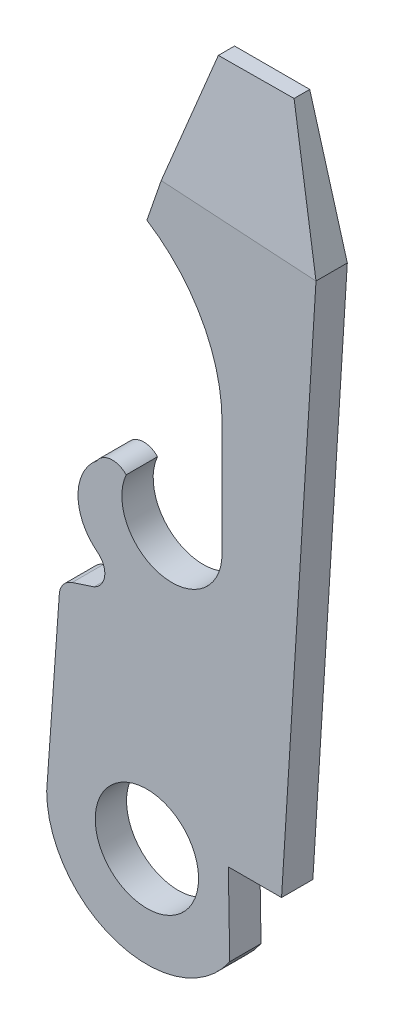
ISO-10303-21;
HEADER;
FILE_DESCRIPTION(('STEP AP214'),'2;1');
FILE_NAME('part.step','',(''),(''),'','','');
FILE_SCHEMA(('AUTOMOTIVE_DESIGN { 1 0 10303 214 1 1 1 1 }'));
ENDSEC;
DATA;
#1=APPLICATION_CONTEXT('core data for automotive mechanical design processes');
#2=APPLICATION_PROTOCOL_DEFINITION('international standard','automotive_design',2000,#1);
#3=PRODUCT_CONTEXT('',#1,'mechanical');
#4=PRODUCT('Part','Part','',(#3));
#5=PRODUCT_RELATED_PRODUCT_CATEGORY('part','',(#4));
#6=PRODUCT_DEFINITION_FORMATION('','',#4);
#7=PRODUCT_DEFINITION_CONTEXT('part definition',#1,'design');
#8=PRODUCT_DEFINITION('design','',#6,#7);
#9=PRODUCT_DEFINITION_SHAPE('','',#8);
#10=(LENGTH_UNIT() NAMED_UNIT(*) SI_UNIT(.MILLI.,.METRE.));
#11=(NAMED_UNIT(*) PLANE_ANGLE_UNIT() SI_UNIT($,.RADIAN.));
#12=(NAMED_UNIT(*) SI_UNIT($,.STERADIAN.) SOLID_ANGLE_UNIT());
#13=UNCERTAINTY_MEASURE_WITH_UNIT(LENGTH_MEASURE(1.E-05),#10,'distance_accuracy_value','');
#14=(GEOMETRIC_REPRESENTATION_CONTEXT(3) GLOBAL_UNCERTAINTY_ASSIGNED_CONTEXT((#13)) GLOBAL_UNIT_ASSIGNED_CONTEXT((#10,
#11,#12)) REPRESENTATION_CONTEXT('',''));
#15=CARTESIAN_POINT('',(0.,0.,0.));
#16=DIRECTION('',(0.,0.,1.));
#17=DIRECTION('',(1.,0.,0.));
#18=AXIS2_PLACEMENT_3D('',#15,#16,#17);
#19=CARTESIAN_POINT('',(47.112724970247,45.3500704609039,1.27));
#20=DIRECTION('',(-0.961523947640823,-0.274721127897379,0.));
#21=DIRECTION('',(0.274721127897379,-0.961523947640823,0.));
#22=AXIS2_PLACEMENT_3D('',#19,#20,#21);
#23=PLANE('',#22);
#24=DIRECTION('',(0.,0.,-1.));
#25=VECTOR('',#24,1.);
#26=CARTESIAN_POINT('',(47.112724970247,45.3500704609039,1.27));
#27=LINE('',#26,#25);
#28=CARTESIAN_POINT('',(47.1127249702472,45.3500704609039,0.635));
#29=VERTEX_POINT('',#28);
#30=CARTESIAN_POINT('',(47.112724970247,45.3500704609039,0.));
#31=VERTEX_POINT('',#30);
#32=EDGE_CURVE('E51',#29,#31,#27,.T.);
#33=ORIENTED_EDGE('',*,*,#32,.F.);
#34=DIRECTION('',(0.272938825911814,-0.955285890691345,0.113724510796589));
#35=VECTOR('',#34,1.);
#36=CARTESIAN_POINT('',(47.1324352651254,45.2810844288294,0.643212622866014));
#37=LINE('',#36,#35);
#38=CARTESIAN_POINT('',(48.636724970247,40.0160704609039,1.27));
#39=VERTEX_POINT('',#38);
#40=EDGE_CURVE('E317',#29,#39,#37,.T.);
#41=ORIENTED_EDGE('',*,*,#40,.T.);
#42=DIRECTION('',(0.,0.,-1.));
#43=VECTOR('',#42,1.);
#44=CARTESIAN_POINT('',(48.636724970247,40.0160704609039,1.27));
#45=LINE('',#44,#43);
#46=CARTESIAN_POINT('',(48.636724970247,40.0160704609039,0.));
#47=VERTEX_POINT('',#46);
#48=EDGE_CURVE('E200',#39,#47,#45,.T.);
#49=ORIENTED_EDGE('',*,*,#48,.T.);
#50=DIRECTION('',(-0.274721127897379,0.961523947640823,0.));
#51=VECTOR('',#50,1.);
#52=CARTESIAN_POINT('',(47.112724970247,45.3500704609039,0.));
#53=LINE('',#52,#51);
#54=EDGE_CURVE('E201',#47,#31,#53,.T.);
#55=ORIENTED_EDGE('',*,*,#54,.T.);
#56=EDGE_LOOP('',(#33,#41,#49,#55));
#57=FACE_BOUND('',#56,.T.);
#58=ADVANCED_FACE('F43',(#57),#23,.F.);
#59=CARTESIAN_POINT('',(44.064724970247,45.3500704609039,1.27));
#60=DIRECTION('',(0.,-1.,0.));
#61=DIRECTION('',(0.,0.,-1.));
#62=AXIS2_PLACEMENT_3D('',#59,#60,#61);
#63=PLANE('',#62);
#64=DIRECTION('',(0.,0.,-1.));
#65=VECTOR('',#64,1.);
#66=CARTESIAN_POINT('',(44.064724970247,45.3500704609039,1.27));
#67=LINE('',#66,#65);
#68=CARTESIAN_POINT('',(44.064724970247,45.3500704609039,0.658090909090911));
#69=VERTEX_POINT('',#68);
#70=CARTESIAN_POINT('',(44.064724970247,45.3500704609039,0.));
#71=VERTEX_POINT('',#70);
#72=EDGE_CURVE('E295',#69,#71,#67,.T.);
#73=ORIENTED_EDGE('',*,*,#72,.F.);
#74=DIRECTION('',(0.999971305183713,0.,-0.00757554019078572));
#75=VECTOR('',#74,1.);
#76=CARTESIAN_POINT('',(44.0600895613517,45.3500704609039,0.658126025824966));
#77=LINE('',#76,#75);
#78=EDGE_CURVE('E308',#69,#29,#77,.T.);
#79=ORIENTED_EDGE('',*,*,#78,.T.);
#80=ORIENTED_EDGE('',*,*,#32,.T.);
#81=DIRECTION('',(-1.,0.,0.));
#82=VECTOR('',#81,1.);
#83=CARTESIAN_POINT('',(44.064724970247,45.3500704609039,0.));
#84=LINE('',#83,#82);
#85=EDGE_CURVE('E205',#31,#71,#84,.T.);
#86=ORIENTED_EDGE('',*,*,#85,.T.);
#87=EDGE_LOOP('',(#73,#79,#80,#86));
#88=FACE_BOUND('',#87,.T.);
#89=ADVANCED_FACE('F305',(#88),#63,.F.);
#90=CARTESIAN_POINT('',(44.064724970247,45.3500704609039,1.27));
#91=DIRECTION('',(0.945338699013941,-0.326090085937353,0.));
#92=DIRECTION('',(0.326090085937353,0.945338699013941,0.));
#93=AXIS2_PLACEMENT_3D('',#90,#91,#92);
#94=PLANE('',#93);
#95=DIRECTION('',(-0.326090085937353,-0.945338699013941,0.));
#96=VECTOR('',#95,1.);
#97=CARTESIAN_POINT('',(44.064724970247,45.3500704609039,1.27));
#98=LINE('',#97,#96);
#99=CARTESIAN_POINT('',(42.3601051845153,40.4083591975121,1.27));
#100=VERTEX_POINT('',#99);
#101=CARTESIAN_POINT('',(41.778724970247,38.7229316451564,1.27));
#102=VERTEX_POINT('',#101);
#103=EDGE_CURVE('E131',#100,#102,#98,.T.);
#104=ORIENTED_EDGE('',*,*,#103,.F.);
#105=DIRECTION('',(0.32387869152296,0.93892784260075,-0.116263061917689));
#106=VECTOR('',#105,1.);
#107=CARTESIAN_POINT('',(44.0416834548802,45.2832728577278,0.666362145198362));
#108=LINE('',#107,#106);
#109=EDGE_CURVE('E57',#100,#69,#108,.T.);
#110=ORIENTED_EDGE('',*,*,#109,.T.);
#111=ORIENTED_EDGE('',*,*,#72,.T.);
#112=DIRECTION('',(-0.326090085937353,-0.945338699013941,0.));
#113=VECTOR('',#112,1.);
#114=CARTESIAN_POINT('',(44.064724970247,45.3500704609039,0.));
#115=LINE('',#114,#113);
#116=CARTESIAN_POINT('',(41.778724970247,38.7229316451564,0.));
#117=VERTEX_POINT('',#116);
#118=EDGE_CURVE('E210',#71,#117,#115,.T.);
#119=ORIENTED_EDGE('',*,*,#118,.T.);
#120=DIRECTION('',(0.,0.,-1.));
#121=VECTOR('',#120,1.);
#122=CARTESIAN_POINT('',(41.778724970247,38.7229316451564,1.27));
#123=LINE('',#122,#121);
#124=EDGE_CURVE('E291',#102,#117,#123,.T.);
#125=ORIENTED_EDGE('',*,*,#124,.F.);
#126=EDGE_LOOP('',(#104,#110,#111,#119,#125));
#127=FACE_BOUND('',#126,.T.);
#128=ADVANCED_FACE('F325',(#127),#94,.F.);
#129=CARTESIAN_POINT('',(38.222724970247,33.1580704609039,1.27));
#130=DIRECTION('',(0.,0.,-1.));
#131=DIRECTION('',(-1.,0.,0.));
#132=AXIS2_PLACEMENT_3D('',#129,#130,#131);
#133=CYLINDRICAL_SURFACE('',#132,6.604);
#134=CARTESIAN_POINT('',(38.222724970247,33.1580704609039,0.));
#135=DIRECTION('',(0.,0.,-1.));
#136=DIRECTION('',(1.,0.,0.));
#137=AXIS2_PLACEMENT_3D('',#134,#135,#136);
#138=CIRCLE('',#137,6.604);
#139=CARTESIAN_POINT('',(44.826724970247,33.1580704609039,0.));
#140=VERTEX_POINT('',#139);
#141=EDGE_CURVE('E213',#117,#140,#138,.T.);
#142=ORIENTED_EDGE('',*,*,#141,.T.);
#143=DIRECTION('',(0.,0.,-1.));
#144=VECTOR('',#143,1.);
#145=CARTESIAN_POINT('',(44.826724970247,33.1580704609039,1.27));
#146=LINE('',#145,#144);
#147=CARTESIAN_POINT('',(44.826724970247,33.1580704609039,1.27));
#148=VERTEX_POINT('',#147);
#149=EDGE_CURVE('E287',#148,#140,#146,.T.);
#150=ORIENTED_EDGE('',*,*,#149,.F.);
#151=CARTESIAN_POINT('',(38.222724970247,33.1580704609039,1.27));
#152=DIRECTION('',(0.,0.,-1.));
#153=DIRECTION('',(1.,0.,0.));
#154=AXIS2_PLACEMENT_3D('',#151,#152,#153);
#155=CIRCLE('',#154,6.604);
#156=EDGE_CURVE('E342',#102,#148,#155,.T.);
#157=ORIENTED_EDGE('',*,*,#156,.F.);
#158=ORIENTED_EDGE('',*,*,#124,.T.);
#159=EDGE_LOOP('',(#142,#150,#157,#158));
#160=FACE_BOUND('',#159,.T.);
#161=ADVANCED_FACE('F492',(#160),#133,.F.);
#162=CARTESIAN_POINT('',(44.826724970247,33.1580704609039,1.27));
#163=DIRECTION('',(1.,0.,0.));
#164=DIRECTION('',(0.,1.,0.));
#165=AXIS2_PLACEMENT_3D('',#162,#163,#164);
#166=PLANE('',#165);
#167=DIRECTION('',(0.,-1.,0.));
#168=VECTOR('',#167,1.);
#169=CARTESIAN_POINT('',(44.826724970247,33.1580704609039,0.));
#170=LINE('',#169,#168);
#171=CARTESIAN_POINT('',(44.826724970247,28.5352704609039,0.));
#172=VERTEX_POINT('',#171);
#173=EDGE_CURVE('E216',#140,#172,#170,.T.);
#174=ORIENTED_EDGE('',*,*,#173,.T.);
#175=DIRECTION('',(0.,0.,-1.));
#176=VECTOR('',#175,1.);
#177=CARTESIAN_POINT('',(44.826724970247,28.5352704609039,1.27));
#178=LINE('',#177,#176);
#179=CARTESIAN_POINT('',(44.826724970247,28.5352704609039,1.27));
#180=VERTEX_POINT('',#179);
#181=EDGE_CURVE('E283',#180,#172,#178,.T.);
#182=ORIENTED_EDGE('',*,*,#181,.F.);
#183=DIRECTION('',(0.,-1.,0.));
#184=VECTOR('',#183,1.);
#185=CARTESIAN_POINT('',(44.826724970247,33.1580704609039,1.27));
#186=LINE('',#185,#184);
#187=EDGE_CURVE('E345',#148,#180,#186,.T.);
#188=ORIENTED_EDGE('',*,*,#187,.F.);
#189=ORIENTED_EDGE('',*,*,#149,.T.);
#190=EDGE_LOOP('',(#174,#182,#188,#189));
#191=FACE_BOUND('',#190,.T.);
#192=ADVANCED_FACE('F497',(#191),#166,.F.);
#193=CARTESIAN_POINT('',(42.794724970247,28.5352704609039,1.27));
#194=DIRECTION('',(0.,0.,-1.));
#195=DIRECTION('',(-1.,0.,0.));
#196=AXIS2_PLACEMENT_3D('',#193,#194,#195);
#197=CYLINDRICAL_SURFACE('',#196,2.032);
#198=CARTESIAN_POINT('',(42.794724970247,28.5352704609039,0.));
#199=DIRECTION('',(0.,0.,-1.));
#200=DIRECTION('',(1.,0.,0.));
#201=AXIS2_PLACEMENT_3D('',#198,#199,#200);
#202=CIRCLE('',#201,2.032);
#203=CARTESIAN_POINT('',(40.9379946226012,29.3608468753752,0.));
#204=VERTEX_POINT('',#203);
#205=EDGE_CURVE('E219',#172,#204,#202,.T.);
#206=ORIENTED_EDGE('',*,*,#205,.T.);
#207=DIRECTION('',(0.,0.,-1.));
#208=VECTOR('',#207,1.);
#209=CARTESIAN_POINT('',(40.9379946226012,29.3608468753752,1.27));
#210=LINE('',#209,#208);
#211=CARTESIAN_POINT('',(40.9379946226012,29.3608468753752,1.27));
#212=VERTEX_POINT('',#211);
#213=EDGE_CURVE('E279',#212,#204,#210,.T.);
#214=ORIENTED_EDGE('',*,*,#213,.F.);
#215=CARTESIAN_POINT('',(42.794724970247,28.5352704609039,1.27));
#216=DIRECTION('',(0.,0.,-1.));
#217=DIRECTION('',(1.,0.,0.));
#218=AXIS2_PLACEMENT_3D('',#215,#216,#217);
#219=CIRCLE('',#218,2.032);
#220=EDGE_CURVE('E348',#180,#212,#219,.T.);
#221=ORIENTED_EDGE('',*,*,#220,.F.);
#222=ORIENTED_EDGE('',*,*,#181,.T.);
#223=EDGE_LOOP('',(#206,#214,#221,#222));
#224=FACE_BOUND('',#223,.T.);
#225=ADVANCED_FACE('F501',(#224),#197,.F.);
#226=CARTESIAN_POINT('',(40.381724970247,28.8400704609039,1.27));
#227=DIRECTION('',(0.,0.,-1.));
#228=DIRECTION('',(-1.,0.,0.));
#229=AXIS2_PLACEMENT_3D('',#226,#227,#228);
#230=CYLINDRICAL_SURFACE('',#229,0.761999999999999);
#231=CARTESIAN_POINT('',(40.381724970247,28.8400704609039,0.));
#232=DIRECTION('',(0.,0.,1.));
#233=DIRECTION('',(1.,0.,0.));
#234=AXIS2_PLACEMENT_3D('',#231,#232,#233);
#235=CIRCLE('',#234,0.761999999999999);
#236=CARTESIAN_POINT('',(39.7420472704938,29.2541434501685,0.));
#237=VERTEX_POINT('',#236);
#238=EDGE_CURVE('E222',#204,#237,#235,.T.);
#239=ORIENTED_EDGE('',*,*,#238,.T.);
#240=DIRECTION('',(0.,0.,-1.));
#241=VECTOR('',#240,1.);
#242=CARTESIAN_POINT('',(39.7420472704938,29.2541434501685,1.27));
#243=LINE('',#242,#241);
#244=CARTESIAN_POINT('',(39.7420472704938,29.2541434501685,1.27));
#245=VERTEX_POINT('',#244);
#246=EDGE_CURVE('E275',#245,#237,#243,.T.);
#247=ORIENTED_EDGE('',*,*,#246,.F.);
#248=CARTESIAN_POINT('',(40.381724970247,28.8400704609039,1.27));
#249=DIRECTION('',(0.,0.,1.));
#250=DIRECTION('',(1.,0.,0.));
#251=AXIS2_PLACEMENT_3D('',#248,#249,#250);
#252=CIRCLE('',#251,0.761999999999999);
#253=EDGE_CURVE('E351',#212,#245,#252,.T.);
#254=ORIENTED_EDGE('',*,*,#253,.F.);
#255=ORIENTED_EDGE('',*,*,#213,.T.);
#256=EDGE_LOOP('',(#239,#247,#254,#255));
#257=FACE_BOUND('',#256,.T.);
#258=ADVANCED_FACE('F505',(#257),#230,.T.);
#259=CARTESIAN_POINT('',(41.016724970247,27.6716704609039,1.27));
#260=DIRECTION('',(0.,0.,-1.));
#261=DIRECTION('',(-1.,0.,0.));
#262=AXIS2_PLACEMENT_3D('',#259,#260,#261);
#263=CYLINDRICAL_SURFACE('',#262,2.032);
#264=CARTESIAN_POINT('',(41.016724970247,27.6716704609039,0.));
#265=DIRECTION('',(0.,0.,1.));
#266=DIRECTION('',(1.,0.,0.));
#267=AXIS2_PLACEMENT_3D('',#264,#265,#266);
#268=CIRCLE('',#267,2.032);
#269=CARTESIAN_POINT('',(39.7768986077313,26.0617466767417,0.));
#270=VERTEX_POINT('',#269);
#271=EDGE_CURVE('E225',#237,#270,#268,.T.);
#272=ORIENTED_EDGE('',*,*,#271,.T.);
#273=DIRECTION('',(0.,0.,-1.));
#274=VECTOR('',#273,1.);
#275=CARTESIAN_POINT('',(39.7768986077313,26.0617466767417,1.27));
#276=LINE('',#275,#274);
#277=CARTESIAN_POINT('',(39.7768986077313,26.0617466767417,1.27));
#278=VERTEX_POINT('',#277);
#279=EDGE_CURVE('E271',#278,#270,#276,.T.);
#280=ORIENTED_EDGE('',*,*,#279,.F.);
#281=CARTESIAN_POINT('',(41.016724970247,27.6716704609039,1.27));
#282=DIRECTION('',(0.,0.,1.));
#283=DIRECTION('',(1.,0.,0.));
#284=AXIS2_PLACEMENT_3D('',#281,#282,#283);
#285=CIRCLE('',#284,2.032);
#286=EDGE_CURVE('E354',#245,#278,#285,.T.);
#287=ORIENTED_EDGE('',*,*,#286,.F.);
#288=ORIENTED_EDGE('',*,*,#246,.T.);
#289=EDGE_LOOP('',(#272,#280,#287,#288));
#290=FACE_BOUND('',#289,.T.);
#291=ADVANCED_FACE('F509',(#290),#263,.T.);
#292=CARTESIAN_POINT('',(39.314924970247,25.4618704609039,1.27));
#293=DIRECTION('',(0.,0.,-1.));
#294=DIRECTION('',(-1.,0.,0.));
#295=AXIS2_PLACEMENT_3D('',#292,#293,#294);
#296=CYLINDRICAL_SURFACE('',#295,0.757146693883276);
#297=CARTESIAN_POINT('',(39.314924970247,25.4618704609039,0.));
#298=DIRECTION('',(0.,0.,-1.));
#299=DIRECTION('',(1.,0.,0.));
#300=AXIS2_PLACEMENT_3D('',#297,#298,#299);
#301=CIRCLE('',#300,0.757146693883276);
#302=CARTESIAN_POINT('',(39.6357823779195,24.7760704609039,0.));
#303=VERTEX_POINT('',#302);
#304=EDGE_CURVE('E228',#270,#303,#301,.T.);
#305=ORIENTED_EDGE('',*,*,#304,.T.);
#306=DIRECTION('',(0.,0.,-1.));
#307=VECTOR('',#306,1.);
#308=CARTESIAN_POINT('',(39.6357823779195,24.7760704609039,1.27));
#309=LINE('',#308,#307);
#310=CARTESIAN_POINT('',(39.6357823779195,24.7760704609039,1.27));
#311=VERTEX_POINT('',#310);
#312=EDGE_CURVE('E267',#311,#303,#309,.T.);
#313=ORIENTED_EDGE('',*,*,#312,.F.);
#314=CARTESIAN_POINT('',(39.314924970247,25.4618704609039,1.27));
#315=DIRECTION('',(0.,0.,-1.));
#316=DIRECTION('',(1.,0.,0.));
#317=AXIS2_PLACEMENT_3D('',#314,#315,#316);
#318=CIRCLE('',#317,0.757146693883276);
#319=EDGE_CURVE('E357',#278,#311,#318,.T.);
#320=ORIENTED_EDGE('',*,*,#319,.F.);
#321=ORIENTED_EDGE('',*,*,#279,.T.);
#322=EDGE_LOOP('',(#305,#313,#320,#321));
#323=FACE_BOUND('',#322,.T.);
#324=ADVANCED_FACE('F513',(#323),#296,.F.);
#325=CARTESIAN_POINT('',(38.746862194299,24.4839940064654,1.27));
#326=DIRECTION('',(0.31215587394745,-0.950030899687007,0.));
#327=DIRECTION('',(0.950030899687007,0.31215587394745,0.));
#328=AXIS2_PLACEMENT_3D('',#325,#326,#327);
#329=PLANE('',#328);
#330=DIRECTION('',(-0.950030899687007,-0.31215587394745,0.));
#331=VECTOR('',#330,1.);
#332=CARTESIAN_POINT('',(38.746862194299,24.4839940064654,0.));
#333=LINE('',#332,#331);
#334=CARTESIAN_POINT('',(38.746862194299,24.4839940064654,0.));
#335=VERTEX_POINT('',#334);
#336=EDGE_CURVE('E231',#303,#335,#333,.T.);
#337=ORIENTED_EDGE('',*,*,#336,.T.);
#338=DIRECTION('',(0.,0.,-1.));
#339=VECTOR('',#338,1.);
#340=CARTESIAN_POINT('',(38.746862194299,24.4839940064654,1.27));
#341=LINE('',#340,#339);
#342=CARTESIAN_POINT('',(38.746862194299,24.4839940064654,1.27));
#343=VERTEX_POINT('',#342);
#344=EDGE_CURVE('E263',#343,#335,#341,.T.);
#345=ORIENTED_EDGE('',*,*,#344,.F.);
#346=DIRECTION('',(-0.950030899687007,-0.31215587394745,0.));
#347=VECTOR('',#346,1.);
#348=CARTESIAN_POINT('',(38.746862194299,24.4839940064654,1.27));
#349=LINE('',#348,#347);
#350=EDGE_CURVE('E360',#311,#343,#349,.T.);
#351=ORIENTED_EDGE('',*,*,#350,.F.);
#352=ORIENTED_EDGE('',*,*,#312,.T.);
#353=EDGE_LOOP('',(#337,#345,#351,#352));
#354=FACE_BOUND('',#353,.T.);
#355=ADVANCED_FACE('F517',(#354),#329,.F.);
#356=CARTESIAN_POINT('',(38.984724970247,23.7600704609039,1.27));
#357=DIRECTION('',(0.,0.,-1.));
#358=DIRECTION('',(-1.,0.,0.));
#359=AXIS2_PLACEMENT_3D('',#356,#357,#358);
#360=CYLINDRICAL_SURFACE('',#359,0.762);
#361=CARTESIAN_POINT('',(38.984724970247,23.7600704609039,0.));
#362=DIRECTION('',(0.,0.,1.));
#363=DIRECTION('',(1.,0.,0.));
#364=AXIS2_PLACEMENT_3D('',#361,#362,#363);
#365=CIRCLE('',#364,0.762);
#366=CARTESIAN_POINT('',(38.222724970247,23.7600704609039,0.));
#367=VERTEX_POINT('',#366);
#368=EDGE_CURVE('E234',#335,#367,#365,.T.);
#369=ORIENTED_EDGE('',*,*,#368,.T.);
#370=DIRECTION('',(0.,0.,-1.));
#371=VECTOR('',#370,1.);
#372=CARTESIAN_POINT('',(38.222724970247,23.7600704609039,1.27));
#373=LINE('',#372,#371);
#374=CARTESIAN_POINT('',(38.222724970247,23.7600704609039,1.27));
#375=VERTEX_POINT('',#374);
#376=EDGE_CURVE('E259',#375,#367,#373,.T.);
#377=ORIENTED_EDGE('',*,*,#376,.F.);
#378=CARTESIAN_POINT('',(38.984724970247,23.7600704609039,1.27));
#379=DIRECTION('',(0.,0.,1.));
#380=DIRECTION('',(1.,0.,0.));
#381=AXIS2_PLACEMENT_3D('',#378,#379,#380);
#382=CIRCLE('',#381,0.762);
#383=EDGE_CURVE('E363',#343,#375,#382,.T.);
#384=ORIENTED_EDGE('',*,*,#383,.F.);
#385=ORIENTED_EDGE('',*,*,#344,.T.);
#386=EDGE_LOOP('',(#369,#377,#384,#385));
#387=FACE_BOUND('',#386,.T.);
#388=ADVANCED_FACE('F469',(#387),#360,.T.);
#389=CARTESIAN_POINT('',(38.222724970247,23.7600704609039,1.27));
#390=DIRECTION('',(0.997458699830735,-0.0712470499879089,0.));
#391=DIRECTION('',(0.0712470499879089,0.997458699830735,0.));
#392=AXIS2_PLACEMENT_3D('',#389,#390,#391);
#393=PLANE('',#392);
#394=DIRECTION('',(-0.0712470499879089,-0.997458699830735,0.));
#395=VECTOR('',#394,1.);
#396=CARTESIAN_POINT('',(38.222724970247,23.7600704609039,0.));
#397=LINE('',#396,#395);
#398=CARTESIAN_POINT('',(37.714724970247,16.6480704609039,0.));
#399=VERTEX_POINT('',#398);
#400=EDGE_CURVE('E237',#367,#399,#397,.T.);
#401=ORIENTED_EDGE('',*,*,#400,.T.);
#402=DIRECTION('',(0.,0.,-1.));
#403=VECTOR('',#402,1.);
#404=CARTESIAN_POINT('',(37.714724970247,16.6480704609039,1.27));
#405=LINE('',#404,#403);
#406=CARTESIAN_POINT('',(37.714724970247,16.6480704609039,1.27));
#407=VERTEX_POINT('',#406);
#408=EDGE_CURVE('E184',#407,#399,#405,.T.);
#409=ORIENTED_EDGE('',*,*,#408,.F.);
#410=DIRECTION('',(-0.0712470499879089,-0.997458699830735,0.));
#411=VECTOR('',#410,1.);
#412=CARTESIAN_POINT('',(38.222724970247,23.7600704609039,1.27));
#413=LINE('',#412,#411);
#414=EDGE_CURVE('E170',#375,#407,#413,.T.);
#415=ORIENTED_EDGE('',*,*,#414,.F.);
#416=ORIENTED_EDGE('',*,*,#376,.T.);
#417=EDGE_LOOP('',(#401,#409,#415,#416));
#418=FACE_BOUND('',#417,.T.);
#419=ADVANCED_FACE('F473',(#418),#393,.F.);
#420=CARTESIAN_POINT('',(41.778724970247,16.6480704609039,1.27));
#421=DIRECTION('',(0.,0.,-1.));
#422=DIRECTION('',(-1.,0.,0.));
#423=AXIS2_PLACEMENT_3D('',#420,#421,#422);
#424=CYLINDRICAL_SURFACE('',#423,4.064);
#425=CARTESIAN_POINT('',(41.778724970247,16.6480704609039,0.));
#426=DIRECTION('',(0.,0.,1.));
#427=DIRECTION('',(1.,0.,0.));
#428=AXIS2_PLACEMENT_3D('',#425,#426,#427);
#429=CIRCLE('',#428,4.064);
#430=CARTESIAN_POINT('',(45.138829135299,14.3620704609039,0.));
#431=VERTEX_POINT('',#430);
#432=EDGE_CURVE('E180',#399,#431,#429,.T.);
#433=ORIENTED_EDGE('',*,*,#432,.T.);
#434=DIRECTION('',(0.,0.,-1.));
#435=VECTOR('',#434,1.);
#436=CARTESIAN_POINT('',(45.138829135299,14.3620704609039,1.27));
#437=LINE('',#436,#435);
#438=CARTESIAN_POINT('',(45.138829135299,14.3620704609039,1.27));
#439=VERTEX_POINT('',#438);
#440=EDGE_CURVE('E177',#439,#431,#437,.T.);
#441=ORIENTED_EDGE('',*,*,#440,.F.);
#442=CARTESIAN_POINT('',(41.778724970247,16.6480704609039,1.27));
#443=DIRECTION('',(0.,0.,1.));
#444=DIRECTION('',(1.,0.,0.));
#445=AXIS2_PLACEMENT_3D('',#442,#443,#444);
#446=CIRCLE('',#445,4.064);
#447=EDGE_CURVE('E162',#407,#439,#446,.T.);
#448=ORIENTED_EDGE('',*,*,#447,.F.);
#449=ORIENTED_EDGE('',*,*,#408,.T.);
#450=EDGE_LOOP('',(#433,#441,#448,#449));
#451=FACE_BOUND('',#450,.T.);
#452=ADVANCED_FACE('F178',(#451),#424,.T.);
#453=CARTESIAN_POINT('',(45.080724970247,17.6640704609039,1.27));
#454=DIRECTION('',(-0.99984521475695,-0.0175939343987647,0.));
#455=DIRECTION('',(0.0175939343987647,-0.99984521475695,0.));
#456=AXIS2_PLACEMENT_3D('',#453,#454,#455);
#457=PLANE('',#456);
#458=DIRECTION('',(-0.0175939343987647,0.99984521475695,0.));
#459=VECTOR('',#458,1.);
#460=CARTESIAN_POINT('',(45.080724970247,17.6640704609039,0.));
#461=LINE('',#460,#459);
#462=CARTESIAN_POINT('',(45.080724970247,17.6640704609039,0.));
#463=VERTEX_POINT('',#462);
#464=EDGE_CURVE('E242',#431,#463,#461,.T.);
#465=ORIENTED_EDGE('',*,*,#464,.T.);
#466=DIRECTION('',(0.,0.,-1.));
#467=VECTOR('',#466,1.);
#468=CARTESIAN_POINT('',(45.080724970247,17.6640704609039,1.27));
#469=LINE('',#468,#467);
#470=CARTESIAN_POINT('',(45.080724970247,17.6640704609039,1.27));
#471=VERTEX_POINT('',#470);
#472=EDGE_CURVE('E185',#471,#463,#469,.T.);
#473=ORIENTED_EDGE('',*,*,#472,.F.);
#474=DIRECTION('',(-0.0175939343987647,0.99984521475695,0.));
#475=VECTOR('',#474,1.);
#476=CARTESIAN_POINT('',(45.080724970247,17.6640704609039,1.27));
#477=LINE('',#476,#475);
#478=EDGE_CURVE('E167',#439,#471,#477,.T.);
#479=ORIENTED_EDGE('',*,*,#478,.F.);
#480=ORIENTED_EDGE('',*,*,#440,.T.);
#481=EDGE_LOOP('',(#465,#473,#479,#480));
#482=FACE_BOUND('',#481,.T.);
#483=ADVANCED_FACE('F187',(#482),#457,.F.);
#484=CARTESIAN_POINT('',(47.239724970247,17.6640704609039,1.27));
#485=DIRECTION('',(0.,1.,0.));
#486=DIRECTION('',(0.,0.,1.));
#487=AXIS2_PLACEMENT_3D('',#484,#485,#486);
#488=PLANE('',#487);
#489=DIRECTION('',(1.,0.,0.));
#490=VECTOR('',#489,1.);
#491=CARTESIAN_POINT('',(47.239724970247,17.6640704609039,0.));
#492=LINE('',#491,#490);
#493=CARTESIAN_POINT('',(47.239724970247,17.6640704609039,0.));
#494=VERTEX_POINT('',#493);
#495=EDGE_CURVE('E245',#463,#494,#492,.T.);
#496=ORIENTED_EDGE('',*,*,#495,.T.);
#497=DIRECTION('',(0.,0.,-1.));
#498=VECTOR('',#497,1.);
#499=CARTESIAN_POINT('',(47.239724970247,17.6640704609039,1.27));
#500=LINE('',#499,#498);
#501=CARTESIAN_POINT('',(47.239724970247,17.6640704609039,1.27));
#502=VERTEX_POINT('',#501);
#503=EDGE_CURVE('E252',#502,#494,#500,.T.);
#504=ORIENTED_EDGE('',*,*,#503,.F.);
#505=DIRECTION('',(1.,0.,0.));
#506=VECTOR('',#505,1.);
#507=CARTESIAN_POINT('',(47.239724970247,17.6640704609039,1.27));
#508=LINE('',#507,#506);
#509=EDGE_CURVE('E66',#471,#502,#508,.T.);
#510=ORIENTED_EDGE('',*,*,#509,.F.);
#511=ORIENTED_EDGE('',*,*,#472,.T.);
#512=EDGE_LOOP('',(#496,#504,#510,#511));
#513=FACE_BOUND('',#512,.T.);
#514=ADVANCED_FACE('F476',(#513),#488,.F.);
#515=CARTESIAN_POINT('',(48.636724970247,40.0160704609039,1.27));
#516=DIRECTION('',(-0.998052578482889,0.0623782861551806,0.));
#517=DIRECTION('',(-0.0623782861551806,-0.998052578482889,0.));
#518=AXIS2_PLACEMENT_3D('',#515,#516,#517);
#519=PLANE('',#518);
#520=DIRECTION('',(0.0623782861551806,0.998052578482889,0.));
#521=VECTOR('',#520,1.);
#522=CARTESIAN_POINT('',(48.636724970247,40.0160704609039,0.));
#523=LINE('',#522,#521);
#524=EDGE_CURVE('E124',#494,#47,#523,.T.);
#525=ORIENTED_EDGE('',*,*,#524,.T.);
#526=ORIENTED_EDGE('',*,*,#48,.F.);
#527=DIRECTION('',(0.0623782861551806,0.998052578482889,0.));
#528=VECTOR('',#527,1.);
#529=CARTESIAN_POINT('',(48.636724970247,40.0160704609039,1.27));
#530=LINE('',#529,#528);
#531=EDGE_CURVE('E194',#502,#39,#530,.T.);
#532=ORIENTED_EDGE('',*,*,#531,.F.);
#533=ORIENTED_EDGE('',*,*,#503,.T.);
#534=EDGE_LOOP('',(#525,#526,#532,#533));
#535=FACE_BOUND('',#534,.T.);
#536=ADVANCED_FACE('F319',(#535),#519,.F.);
#537=CARTESIAN_POINT('',(41.778724970247,16.6480704609039,1.27));
#538=DIRECTION('',(0.,0.,1.));
#539=DIRECTION('',(1.,0.,0.));
#540=AXIS2_PLACEMENT_3D('',#537,#538,#539);
#541=PLANE('',#540);
#542=DIRECTION('',(0.998052578482889,-0.0623782861551806,0.));
#543=VECTOR('',#542,1.);
#544=CARTESIAN_POINT('',(43.2602269157723,40.3521015893086,1.27));
#545=LINE('',#544,#543);
#546=EDGE_CURVE('E11',#100,#39,#545,.T.);
#547=ORIENTED_EDGE('',*,*,#546,.F.);
#548=ORIENTED_EDGE('',*,*,#103,.T.);
#549=ORIENTED_EDGE('',*,*,#156,.T.);
#550=ORIENTED_EDGE('',*,*,#187,.T.);
#551=ORIENTED_EDGE('',*,*,#220,.T.);
#552=ORIENTED_EDGE('',*,*,#253,.T.);
#553=ORIENTED_EDGE('',*,*,#286,.T.);
#554=ORIENTED_EDGE('',*,*,#319,.T.);
#555=ORIENTED_EDGE('',*,*,#350,.T.);
#556=ORIENTED_EDGE('',*,*,#383,.T.);
#557=ORIENTED_EDGE('',*,*,#414,.T.);
#558=ORIENTED_EDGE('',*,*,#447,.T.);
#559=ORIENTED_EDGE('',*,*,#478,.T.);
#560=ORIENTED_EDGE('',*,*,#509,.T.);
#561=ORIENTED_EDGE('',*,*,#531,.T.);
#562=EDGE_LOOP('',(#547,#548,#549,#550,#551,#552,#553,#554,#555,#556,#557,#558,#559,#560,#561));
#563=FACE_BOUND('',#562,.T.);
#564=CARTESIAN_POINT('',(41.778724970247,16.6480704609039,1.27));
#565=DIRECTION('',(0.,0.,1.));
#566=DIRECTION('',(1.,0.,0.));
#567=AXIS2_PLACEMENT_3D('',#564,#565,#566);
#568=CIRCLE('',#567,2.0955);
#569=CARTESIAN_POINT('',(43.874224970247,16.6480704609039,1.27));
#570=VERTEX_POINT('',#569);
#571=EDGE_CURVE('E333',#570,#570,#568,.T.);
#572=ORIENTED_EDGE('',*,*,#571,.F.);
#573=EDGE_LOOP('',(#572));
#574=FACE_BOUND('',#573,.T.);
#575=ADVANCED_FACE('F164',(#563,#574),#541,.T.);
#576=CARTESIAN_POINT('',(41.778724970247,16.6480704609039,0.));
#577=DIRECTION('',(0.,0.,1.));
#578=DIRECTION('',(1.,0.,0.));
#579=AXIS2_PLACEMENT_3D('',#576,#577,#578);
#580=PLANE('',#579);
#581=CARTESIAN_POINT('',(41.778724970247,16.6480704609039,0.));
#582=DIRECTION('',(0.,0.,1.));
#583=DIRECTION('',(1.,0.,0.));
#584=AXIS2_PLACEMENT_3D('',#581,#582,#583);
#585=CIRCLE('',#584,2.0955);
#586=CARTESIAN_POINT('',(43.874224970247,16.6480704609039,0.));
#587=VERTEX_POINT('',#586);
#588=EDGE_CURVE('E206',#587,#587,#585,.T.);
#589=ORIENTED_EDGE('',*,*,#588,.T.);
#590=EDGE_LOOP('',(#589));
#591=FACE_BOUND('',#590,.T.);
#592=ORIENTED_EDGE('',*,*,#54,.F.);
#593=ORIENTED_EDGE('',*,*,#524,.F.);
#594=ORIENTED_EDGE('',*,*,#495,.F.);
#595=ORIENTED_EDGE('',*,*,#464,.F.);
#596=ORIENTED_EDGE('',*,*,#432,.F.);
#597=ORIENTED_EDGE('',*,*,#400,.F.);
#598=ORIENTED_EDGE('',*,*,#368,.F.);
#599=ORIENTED_EDGE('',*,*,#336,.F.);
#600=ORIENTED_EDGE('',*,*,#304,.F.);
#601=ORIENTED_EDGE('',*,*,#271,.F.);
#602=ORIENTED_EDGE('',*,*,#238,.F.);
#603=ORIENTED_EDGE('',*,*,#205,.F.);
#604=ORIENTED_EDGE('',*,*,#173,.F.);
#605=ORIENTED_EDGE('',*,*,#141,.F.);
#606=ORIENTED_EDGE('',*,*,#118,.F.);
#607=ORIENTED_EDGE('',*,*,#85,.F.);
#608=EDGE_LOOP('',(#592,#593,#594,#595,#596,#597,#598,#599,#600,#601,#602,#603,#604,#605,#606,#607));
#609=FACE_BOUND('',#608,.T.);
#610=ADVANCED_FACE('F313',(#591,#609),#580,.F.);
#611=CARTESIAN_POINT('',(41.778724970247,16.6480704609039,0.));
#612=DIRECTION('',(0.,0.,1.));
#613=DIRECTION('',(1.,0.,0.));
#614=AXIS2_PLACEMENT_3D('',#611,#612,#613);
#615=CYLINDRICAL_SURFACE('',#614,2.0955);
#616=ORIENTED_EDGE('',*,*,#588,.F.);
#617=EDGE_LOOP('',(#616));
#618=FACE_BOUND('',#617,.T.);
#619=ORIENTED_EDGE('',*,*,#571,.T.);
#620=EDGE_LOOP('',(#619));
#621=FACE_BOUND('',#620,.T.);
#622=ADVANCED_FACE('F564',(#618,#621),#615,.F.);
#623=CARTESIAN_POINT('',(37.7512930636322,45.9351599550673,0.635));
#624=DIRECTION('',(-0.00752049778919867,-0.120327964627178,-0.992705708174222));
#625=DIRECTION('',(0.,0.992733782033708,-0.120331367519237));
#626=AXIS2_PLACEMENT_3D('',#623,#624,#625);
#627=PLANE('',#626);
#628=ORIENTED_EDGE('',*,*,#78,.F.);
#629=ORIENTED_EDGE('',*,*,#109,.F.);
#630=ORIENTED_EDGE('',*,*,#546,.T.);
#631=ORIENTED_EDGE('',*,*,#40,.F.);
#632=EDGE_LOOP('',(#628,#629,#630,#631));
#633=FACE_BOUND('',#632,.T.);
#634=ADVANCED_FACE('F321',(#633),#627,.F.);
#635=CLOSED_SHELL('',(#58,#89,#128,#161,#192,#225,#258,#291,#324,#355,#388,#419,#452,#483,#514,
#536,#575,#610,#622,#634));
#636=MANIFOLD_SOLID_BREP('B2',#635);
#637=ADVANCED_BREP_SHAPE_REPRESENTATION('',(#18,#636),#14);
#638=SHAPE_DEFINITION_REPRESENTATION(#9,#637);
ENDSEC;
END-ISO-10303-21;
